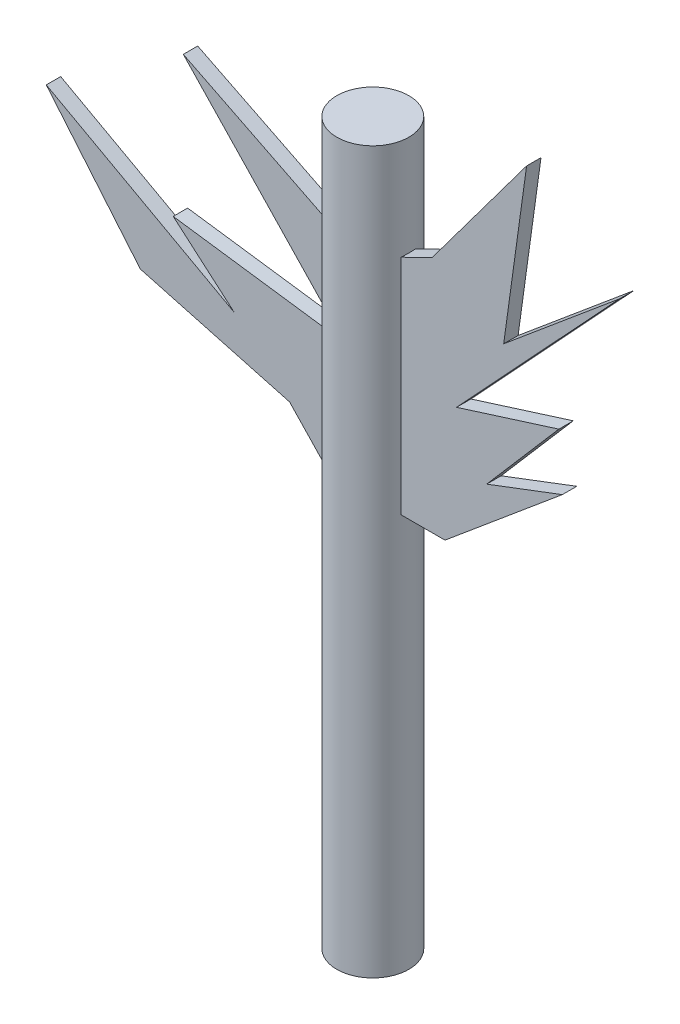
ISO-10303-21;
HEADER;
FILE_DESCRIPTION(('STEP AP214'),'2;1');
FILE_NAME('part.step','',(''),(''),'','','');
FILE_SCHEMA(('AUTOMOTIVE_DESIGN { 1 0 10303 214 1 1 1 1 }'));
ENDSEC;
DATA;
#1=APPLICATION_CONTEXT('core data for automotive mechanical design processes');
#2=APPLICATION_PROTOCOL_DEFINITION('international standard','automotive_design',2000,#1);
#3=PRODUCT_CONTEXT('',#1,'mechanical');
#4=PRODUCT('Part','Part','',(#3));
#5=PRODUCT_RELATED_PRODUCT_CATEGORY('part','',(#4));
#6=PRODUCT_DEFINITION_FORMATION('','',#4);
#7=PRODUCT_DEFINITION_CONTEXT('part definition',#1,'design');
#8=PRODUCT_DEFINITION('design','',#6,#7);
#9=PRODUCT_DEFINITION_SHAPE('','',#8);
#10=(LENGTH_UNIT() NAMED_UNIT(*) SI_UNIT(.MILLI.,.METRE.));
#11=(NAMED_UNIT(*) PLANE_ANGLE_UNIT() SI_UNIT($,.RADIAN.));
#12=(NAMED_UNIT(*) SI_UNIT($,.STERADIAN.) SOLID_ANGLE_UNIT());
#13=UNCERTAINTY_MEASURE_WITH_UNIT(LENGTH_MEASURE(1.E-05),#10,'distance_accuracy_value','');
#14=(GEOMETRIC_REPRESENTATION_CONTEXT(3) GLOBAL_UNCERTAINTY_ASSIGNED_CONTEXT((#13)) GLOBAL_UNIT_ASSIGNED_CONTEXT((#10,
#11,#12)) REPRESENTATION_CONTEXT('',''));
#15=CARTESIAN_POINT('',(0.,0.,0.));
#16=DIRECTION('',(0.,0.,1.));
#17=DIRECTION('',(1.,0.,0.));
#18=AXIS2_PLACEMENT_3D('',#15,#16,#17);
#19=CARTESIAN_POINT('',(0.,500.,0.));
#20=DIRECTION('',(0.,-1.,0.));
#21=DIRECTION('',(0.,0.,-1.));
#22=AXIS2_PLACEMENT_3D('',#19,#20,#21);
#23=CYLINDRICAL_SURFACE('',#22,25.);
#24=DIRECTION('',(0.,-1.,0.));
#25=VECTOR('',#24,1.);
#26=CARTESIAN_POINT('',(24.4948974278318,500.,-5.));
#27=LINE('',#26,#25);
#28=CARTESIAN_POINT('',(24.4948974278318,275.438238438683,-5.));
#29=VERTEX_POINT('',#28);
#30=CARTESIAN_POINT('',(24.4948974278318,430.165062365863,-5.));
#31=VERTEX_POINT('',#30);
#32=EDGE_CURVE('E414',#29,#31,#27,.F.);
#33=ORIENTED_EDGE('',*,*,#32,.F.);
#34=CARTESIAN_POINT('',(0.,275.438238438683,0.));
#35=DIRECTION('',(0.,-1.,0.));
#36=DIRECTION('',(0.,0.,-1.));
#37=AXIS2_PLACEMENT_3D('',#34,#35,#36);
#38=CIRCLE('',#37,25.);
#39=CARTESIAN_POINT('',(24.4948974278318,275.438238438683,5.));
#40=VERTEX_POINT('',#39);
#41=EDGE_CURVE('E404',#29,#40,#38,.T.);
#42=ORIENTED_EDGE('',*,*,#41,.T.);
#43=DIRECTION('',(0.,-1.,0.));
#44=VECTOR('',#43,1.);
#45=CARTESIAN_POINT('',(24.4948974278318,500.,5.));
#46=LINE('',#45,#44);
#47=CARTESIAN_POINT('',(24.4948974278318,430.165062365863,5.));
#48=VERTEX_POINT('',#47);
#49=EDGE_CURVE('E397',#40,#48,#46,.F.);
#50=ORIENTED_EDGE('',*,*,#49,.T.);
#51=CARTESIAN_POINT('',(0.,418.254378528517,0.));
#52=DIRECTION('',(-0.437294922049526,0.899318159023657,0.));
#53=DIRECTION('',(-0.899318159023657,-0.437294922049526,0.));
#54=AXIS2_PLACEMENT_3D('',#51,#52,#53);
#55=ELLIPSE('',#54,27.7988382077609,25.);
#56=EDGE_CURVE('E408',#48,#31,#55,.T.);
#57=ORIENTED_EDGE('',*,*,#56,.T.);
#58=EDGE_LOOP('',(#33,#42,#50,#57));
#59=FACE_BOUND('',#58,.T.);
#60=CARTESIAN_POINT('',(0.,500.,0.));
#61=DIRECTION('',(0.,1.,0.));
#62=DIRECTION('',(0.,0.,1.));
#63=AXIS2_PLACEMENT_3D('',#60,#61,#62);
#64=CIRCLE('',#63,25.);
#65=CARTESIAN_POINT('',(0.,500.,25.));
#66=VERTEX_POINT('',#65);
#67=EDGE_CURVE('E393',#66,#66,#64,.T.);
#68=ORIENTED_EDGE('',*,*,#67,.F.);
#69=EDGE_LOOP('',(#68));
#70=FACE_BOUND('',#69,.T.);
#71=CARTESIAN_POINT('',(0.,0.,0.));
#72=DIRECTION('',(0.,1.,0.));
#73=DIRECTION('',(0.,0.,1.));
#74=AXIS2_PLACEMENT_3D('',#71,#72,#73);
#75=CIRCLE('',#74,25.);
#76=CARTESIAN_POINT('',(0.,0.,25.));
#77=VERTEX_POINT('',#76);
#78=EDGE_CURVE('E347',#77,#77,#75,.T.);
#79=ORIENTED_EDGE('',*,*,#78,.T.);
#80=EDGE_LOOP('',(#79));
#81=FACE_BOUND('',#80,.T.);
#82=CARTESIAN_POINT('',(-24.4948974278318,275.438238438683,5.));
#83=VERTEX_POINT('',#82);
#84=CARTESIAN_POINT('',(-25.,275.438238438683,0.));
#85=VERTEX_POINT('',#84);
#86=EDGE_CURVE('E410',#83,#85,#38,.T.);
#87=ORIENTED_EDGE('',*,*,#86,.T.);
#88=CARTESIAN_POINT('',(-24.4948974278318,275.438238438683,-5.));
#89=VERTEX_POINT('',#88);
#90=EDGE_CURVE('E409',#85,#89,#38,.T.);
#91=ORIENTED_EDGE('',*,*,#90,.T.);
#92=DIRECTION('',(0.,-1.,0.));
#93=VECTOR('',#92,1.);
#94=CARTESIAN_POINT('',(-24.4948974278318,500.,-5.));
#95=LINE('',#94,#93);
#96=CARTESIAN_POINT('',(-24.4948974278318,360.607588319083,-5.));
#97=VERTEX_POINT('',#96);
#98=EDGE_CURVE('E49',#97,#89,#95,.T.);
#99=ORIENTED_EDGE('',*,*,#98,.F.);
#100=CARTESIAN_POINT('',(0.,357.216085375604,0.));
#101=DIRECTION('',(0.13714916051898,0.990550406475581,0.));
#102=DIRECTION('',(0.990550406475581,-0.13714916051898,0.));
#103=AXIS2_PLACEMENT_3D('',#100,#101,#102);
#104=ELLIPSE('',#103,25.2384935047889,25.);
#105=CARTESIAN_POINT('',(-24.4948974278318,360.607588319083,5.));
#106=VERTEX_POINT('',#105);
#107=EDGE_CURVE('E421',#97,#106,#104,.T.);
#108=ORIENTED_EDGE('',*,*,#107,.T.);
#109=DIRECTION('',(0.,-1.,0.));
#110=VECTOR('',#109,1.);
#111=CARTESIAN_POINT('',(-24.4948974278318,500.,5.));
#112=LINE('',#111,#110);
#113=EDGE_CURVE('E417',#106,#83,#112,.T.);
#114=ORIENTED_EDGE('',*,*,#113,.T.);
#115=EDGE_LOOP('',(#87,#91,#99,#108,#114));
#116=FACE_BOUND('',#115,.T.);
#117=CARTESIAN_POINT('',(-24.4948974278318,425.650247278352,-5.));
#118=VERTEX_POINT('',#117);
#119=CARTESIAN_POINT('',(-24.4948974278318,369.410425604163,-5.));
#120=VERTEX_POINT('',#119);
#121=EDGE_CURVE('E11',#118,#120,#95,.T.);
#122=ORIENTED_EDGE('',*,*,#121,.F.);
#123=CARTESIAN_POINT('',(0.,413.421374076424,0.));
#124=DIRECTION('',(0.446670723166173,0.89469842129413,0.));
#125=DIRECTION('',(0.89469842129413,-0.446670723166173,0.));
#126=AXIS2_PLACEMENT_3D('',#123,#124,#125);
#127=ELLIPSE('',#126,27.9423763415598,25.);
#128=CARTESIAN_POINT('',(-24.4948974278318,425.650247278352,5.));
#129=VERTEX_POINT('',#128);
#130=EDGE_CURVE('E425',#118,#129,#127,.T.);
#131=ORIENTED_EDGE('',*,*,#130,.T.);
#132=CARTESIAN_POINT('',(-24.4948974278318,369.410425604163,5.));
#133=VERTEX_POINT('',#132);
#134=EDGE_CURVE('E195',#129,#133,#112,.T.);
#135=ORIENTED_EDGE('',*,*,#134,.T.);
#136=CARTESIAN_POINT('',(0.,343.673383714767,0.));
#137=DIRECTION('',(-0.724370808954964,-0.689410567901255,0.));
#138=DIRECTION('',(0.689410567901255,-0.724370808954964,0.));
#139=AXIS2_PLACEMENT_3D('',#136,#137,#138);
#140=ELLIPSE('',#139,36.2628615863933,25.);
#141=EDGE_CURVE('E42',#133,#120,#140,.T.);
#142=ORIENTED_EDGE('',*,*,#141,.T.);
#143=EDGE_LOOP('',(#122,#131,#135,#142));
#144=FACE_BOUND('',#143,.T.);
#145=ADVANCED_FACE('F39',(#59,#70,#81,#116,#144),#23,.T.);
#146=CARTESIAN_POINT('',(0.,500.,0.));
#147=DIRECTION('',(0.,1.,0.));
#148=DIRECTION('',(0.,0.,1.));
#149=AXIS2_PLACEMENT_3D('',#146,#147,#148);
#150=PLANE('',#149);
#151=ORIENTED_EDGE('',*,*,#67,.T.);
#152=EDGE_LOOP('',(#151));
#153=FACE_BOUND('',#152,.T.);
#154=ADVANCED_FACE('F480',(#153),#150,.T.);
#155=CARTESIAN_POINT('',(0.,0.,0.));
#156=DIRECTION('',(0.,1.,0.));
#157=DIRECTION('',(0.,0.,1.));
#158=AXIS2_PLACEMENT_3D('',#155,#156,#157);
#159=PLANE('',#158);
#160=ORIENTED_EDGE('',*,*,#78,.F.);
#161=EDGE_LOOP('',(#160));
#162=FACE_BOUND('',#161,.T.);
#163=ADVANCED_FACE('F485',(#162),#159,.F.);
#164=CARTESIAN_POINT('',(111.692244321732,528.591191642201,-5.));
#165=DIRECTION('',(-0.801444478864867,0.598069182701317,0.));
#166=DIRECTION('',(-0.598069182701317,-0.801444478864867,0.));
#167=AXIS2_PLACEMENT_3D('',#164,#165,#166);
#168=PLANE('',#167);
#169=DIRECTION('',(0.,0.,1.));
#170=VECTOR('',#169,1.);
#171=CARTESIAN_POINT('',(46.0724517401596,440.657183353693,-5.));
#172=LINE('',#171,#170);
#173=CARTESIAN_POINT('',(46.0724517401596,440.657183353693,-5.));
#174=VERTEX_POINT('',#173);
#175=CARTESIAN_POINT('',(46.0724517401596,440.657183353693,5.));
#176=VERTEX_POINT('',#175);
#177=EDGE_CURVE('E344',#174,#176,#172,.T.);
#178=ORIENTED_EDGE('',*,*,#177,.T.);
#179=DIRECTION('',(-0.598069182701317,-0.801444478864867,0.));
#180=VECTOR('',#179,1.);
#181=CARTESIAN_POINT('',(111.692244321732,528.591191642201,5.));
#182=LINE('',#181,#180);
#183=CARTESIAN_POINT('',(111.692244321732,528.591191642201,5.));
#184=VERTEX_POINT('',#183);
#185=EDGE_CURVE('E272',#184,#176,#182,.T.);
#186=ORIENTED_EDGE('',*,*,#185,.F.);
#187=DIRECTION('',(0.,0.,1.));
#188=VECTOR('',#187,1.);
#189=CARTESIAN_POINT('',(111.692244321732,528.591191642201,-5.));
#190=LINE('',#189,#188);
#191=CARTESIAN_POINT('',(111.692244321732,528.591191642201,-5.));
#192=VERTEX_POINT('',#191);
#193=EDGE_CURVE('E348',#192,#184,#190,.T.);
#194=ORIENTED_EDGE('',*,*,#193,.F.);
#195=DIRECTION('',(-0.598069182701317,-0.801444478864867,0.));
#196=VECTOR('',#195,1.);
#197=CARTESIAN_POINT('',(111.692244321732,528.591191642201,-5.));
#198=LINE('',#197,#196);
#199=EDGE_CURVE('E211',#192,#174,#198,.T.);
#200=ORIENTED_EDGE('',*,*,#199,.T.);
#201=EDGE_LOOP('',(#178,#186,#194,#200));
#202=FACE_BOUND('',#201,.T.);
#203=ADVANCED_FACE('F495',(#202),#168,.T.);
#204=CARTESIAN_POINT('',(95.7950470712416,413.774774693616,-5.));
#205=DIRECTION('',(0.990550406475581,-0.13714916051898,0.));
#206=DIRECTION('',(0.13714916051898,0.990550406475581,0.));
#207=AXIS2_PLACEMENT_3D('',#204,#205,#206);
#208=PLANE('',#207);
#209=ORIENTED_EDGE('',*,*,#193,.T.);
#210=DIRECTION('',(0.13714916051898,0.990550406475581,0.));
#211=VECTOR('',#210,1.);
#212=CARTESIAN_POINT('',(95.7950470712416,413.774774693616,5.));
#213=LINE('',#212,#211);
#214=CARTESIAN_POINT('',(95.7950470712416,413.774774693616,5.));
#215=VERTEX_POINT('',#214);
#216=EDGE_CURVE('E268',#215,#184,#213,.T.);
#217=ORIENTED_EDGE('',*,*,#216,.F.);
#218=DIRECTION('',(0.,0.,1.));
#219=VECTOR('',#218,1.);
#220=CARTESIAN_POINT('',(95.7950470712416,413.774774693616,-5.));
#221=LINE('',#220,#219);
#222=CARTESIAN_POINT('',(95.7950470712416,413.774774693616,-5.));
#223=VERTEX_POINT('',#222);
#224=EDGE_CURVE('E351',#223,#215,#221,.T.);
#225=ORIENTED_EDGE('',*,*,#224,.F.);
#226=DIRECTION('',(0.13714916051898,0.990550406475581,0.));
#227=VECTOR('',#226,1.);
#228=CARTESIAN_POINT('',(95.7950470712416,413.774774693616,-5.));
#229=LINE('',#228,#227);
#230=EDGE_CURVE('E337',#223,#192,#229,.T.);
#231=ORIENTED_EDGE('',*,*,#230,.T.);
#232=EDGE_LOOP('',(#209,#217,#225,#231));
#233=FACE_BOUND('',#232,.T.);
#234=ADVANCED_FACE('F499',(#233),#208,.T.);
#235=CARTESIAN_POINT('',(176.005774191457,480.837199539356,-5.));
#236=DIRECTION('',(-0.64142625339715,0.767184698395957,0.));
#237=DIRECTION('',(-0.767184698395957,-0.64142625339715,0.));
#238=AXIS2_PLACEMENT_3D('',#235,#236,#237);
#239=PLANE('',#238);
#240=ORIENTED_EDGE('',*,*,#224,.T.);
#241=DIRECTION('',(-0.767184698395957,-0.64142625339715,0.));
#242=VECTOR('',#241,1.);
#243=CARTESIAN_POINT('',(176.005774191457,480.837199539356,5.));
#244=LINE('',#243,#242);
#245=CARTESIAN_POINT('',(176.005774191457,480.837199539356,5.));
#246=VERTEX_POINT('',#245);
#247=EDGE_CURVE('E264',#246,#215,#244,.T.);
#248=ORIENTED_EDGE('',*,*,#247,.F.);
#249=DIRECTION('',(0.,0.,1.));
#250=VECTOR('',#249,1.);
#251=CARTESIAN_POINT('',(176.005774191457,480.837199539356,-5.));
#252=LINE('',#251,#250);
#253=CARTESIAN_POINT('',(176.005774191457,480.837199539356,-5.));
#254=VERTEX_POINT('',#253);
#255=EDGE_CURVE('E354',#254,#246,#252,.T.);
#256=ORIENTED_EDGE('',*,*,#255,.F.);
#257=DIRECTION('',(-0.767184698395957,-0.64142625339715,0.));
#258=VECTOR('',#257,1.);
#259=CARTESIAN_POINT('',(176.005774191457,480.837199539356,-5.));
#260=LINE('',#259,#258);
#261=EDGE_CURVE('E333',#254,#223,#260,.T.);
#262=ORIENTED_EDGE('',*,*,#261,.T.);
#263=EDGE_LOOP('',(#240,#248,#256,#262));
#264=FACE_BOUND('',#263,.T.);
#265=ADVANCED_FACE('F642',(#264),#239,.T.);
#266=CARTESIAN_POINT('',(63.0845103352759,359.271534235287,-5.));
#267=DIRECTION('',(0.732676695908877,-0.680576857725894,0.));
#268=DIRECTION('',(0.680576857725894,0.732676695908877,0.));
#269=AXIS2_PLACEMENT_3D('',#266,#267,#268);
#270=PLANE('',#269);
#271=ORIENTED_EDGE('',*,*,#255,.T.);
#272=DIRECTION('',(0.680576857725894,0.732676695908877,0.));
#273=VECTOR('',#272,1.);
#274=CARTESIAN_POINT('',(63.0845103352759,359.271534235287,5.));
#275=LINE('',#274,#273);
#276=CARTESIAN_POINT('',(63.0845103352759,359.271534235287,5.));
#277=VERTEX_POINT('',#276);
#278=EDGE_CURVE('E260',#277,#246,#275,.T.);
#279=ORIENTED_EDGE('',*,*,#278,.F.);
#280=DIRECTION('',(0.,0.,1.));
#281=VECTOR('',#280,1.);
#282=CARTESIAN_POINT('',(63.0845103352759,359.271534235287,-5.));
#283=LINE('',#282,#281);
#284=CARTESIAN_POINT('',(63.0845103352759,359.271534235287,-5.));
#285=VERTEX_POINT('',#284);
#286=EDGE_CURVE('E357',#285,#277,#283,.T.);
#287=ORIENTED_EDGE('',*,*,#286,.F.);
#288=DIRECTION('',(0.680576857725894,0.732676695908877,0.));
#289=VECTOR('',#288,1.);
#290=CARTESIAN_POINT('',(63.0845103352759,359.271534235287,-5.));
#291=LINE('',#290,#289);
#292=EDGE_CURVE('E329',#285,#254,#291,.T.);
#293=ORIENTED_EDGE('',*,*,#292,.T.);
#294=EDGE_LOOP('',(#271,#279,#287,#293));
#295=FACE_BOUND('',#294,.T.);
#296=ADVANCED_FACE('F637',(#295),#270,.T.);
#297=CARTESIAN_POINT('',(134.080402496634,381.655252368529,-5.));
#298=DIRECTION('',(-0.30069112863177,0.953721576332502,0.));
#299=DIRECTION('',(-0.953721576332502,-0.30069112863177,0.));
#300=AXIS2_PLACEMENT_3D('',#297,#298,#299);
#301=PLANE('',#300);
#302=ORIENTED_EDGE('',*,*,#286,.T.);
#303=DIRECTION('',(-0.953721576332502,-0.30069112863177,0.));
#304=VECTOR('',#303,1.);
#305=CARTESIAN_POINT('',(134.080402496634,381.655252368529,5.));
#306=LINE('',#305,#304);
#307=CARTESIAN_POINT('',(134.080402496634,381.655252368529,5.));
#308=VERTEX_POINT('',#307);
#309=EDGE_CURVE('E256',#308,#277,#306,.T.);
#310=ORIENTED_EDGE('',*,*,#309,.F.);
#311=DIRECTION('',(0.,0.,1.));
#312=VECTOR('',#311,1.);
#313=CARTESIAN_POINT('',(134.080402496634,381.655252368529,-5.));
#314=LINE('',#313,#312);
#315=CARTESIAN_POINT('',(134.080402496634,381.655252368529,-5.));
#316=VERTEX_POINT('',#315);
#317=EDGE_CURVE('E360',#316,#308,#314,.T.);
#318=ORIENTED_EDGE('',*,*,#317,.F.);
#319=DIRECTION('',(-0.953721576332502,-0.30069112863177,0.));
#320=VECTOR('',#319,1.);
#321=CARTESIAN_POINT('',(134.080402496634,381.655252368529,-5.));
#322=LINE('',#321,#320);
#323=EDGE_CURVE('E325',#316,#285,#322,.T.);
#324=ORIENTED_EDGE('',*,*,#323,.T.);
#325=EDGE_LOOP('',(#302,#310,#318,#324));
#326=FACE_BOUND('',#325,.T.);
#327=ADVANCED_FACE('F632',(#326),#301,.T.);
#328=CARTESIAN_POINT('',(84.0090542982762,323.576399454984,-5.));
#329=DIRECTION('',(0.757388217453221,-0.652964844431178,0.));
#330=DIRECTION('',(0.652964844431178,0.757388217453221,0.));
#331=AXIS2_PLACEMENT_3D('',#328,#329,#330);
#332=PLANE('',#331);
#333=ORIENTED_EDGE('',*,*,#317,.T.);
#334=DIRECTION('',(0.652964844431178,0.757388217453221,0.));
#335=VECTOR('',#334,1.);
#336=CARTESIAN_POINT('',(84.0090542982762,323.576399454984,5.));
#337=LINE('',#336,#335);
#338=CARTESIAN_POINT('',(84.0090542982762,323.576399454984,5.));
#339=VERTEX_POINT('',#338);
#340=EDGE_CURVE('E252',#339,#308,#337,.T.);
#341=ORIENTED_EDGE('',*,*,#340,.F.);
#342=DIRECTION('',(0.,0.,1.));
#343=VECTOR('',#342,1.);
#344=CARTESIAN_POINT('',(84.0090542982762,323.576399454984,-5.));
#345=LINE('',#344,#343);
#346=CARTESIAN_POINT('',(84.0090542982762,323.576399454984,-5.));
#347=VERTEX_POINT('',#346);
#348=EDGE_CURVE('E363',#347,#339,#345,.T.);
#349=ORIENTED_EDGE('',*,*,#348,.F.);
#350=DIRECTION('',(0.652964844431178,0.757388217453221,0.));
#351=VECTOR('',#350,1.);
#352=CARTESIAN_POINT('',(84.0090542982762,323.576399454984,-5.));
#353=LINE('',#352,#351);
#354=EDGE_CURVE('E321',#347,#316,#353,.T.);
#355=ORIENTED_EDGE('',*,*,#354,.T.);
#356=EDGE_LOOP('',(#333,#341,#349,#355));
#357=FACE_BOUND('',#356,.T.);
#358=ADVANCED_FACE('F630',(#357),#332,.T.);
#359=CARTESIAN_POINT('',(136.510624595424,343.521036233899,-5.));
#360=DIRECTION('',(-0.355125029197698,0.934818813266685,0.));
#361=DIRECTION('',(-0.934818813266686,-0.355125029197698,0.));
#362=AXIS2_PLACEMENT_3D('',#359,#360,#361);
#363=PLANE('',#362);
#364=ORIENTED_EDGE('',*,*,#348,.T.);
#365=DIRECTION('',(-0.934818813266686,-0.355125029197698,0.));
#366=VECTOR('',#365,1.);
#367=CARTESIAN_POINT('',(136.510624595424,343.521036233899,5.));
#368=LINE('',#367,#366);
#369=CARTESIAN_POINT('',(136.510624595424,343.521036233899,5.));
#370=VERTEX_POINT('',#369);
#371=EDGE_CURVE('E248',#370,#339,#368,.T.);
#372=ORIENTED_EDGE('',*,*,#371,.F.);
#373=DIRECTION('',(0.,0.,1.));
#374=VECTOR('',#373,1.);
#375=CARTESIAN_POINT('',(136.510624595424,343.521036233899,-5.));
#376=LINE('',#375,#374);
#377=CARTESIAN_POINT('',(136.510624595424,343.521036233899,-5.));
#378=VERTEX_POINT('',#377);
#379=EDGE_CURVE('E366',#378,#370,#376,.T.);
#380=ORIENTED_EDGE('',*,*,#379,.F.);
#381=DIRECTION('',(-0.934818813266686,-0.355125029197698,0.));
#382=VECTOR('',#381,1.);
#383=CARTESIAN_POINT('',(136.510624595424,343.521036233899,-5.));
#384=LINE('',#383,#382);
#385=EDGE_CURVE('E317',#378,#347,#384,.T.);
#386=ORIENTED_EDGE('',*,*,#385,.T.);
#387=EDGE_LOOP('',(#364,#372,#380,#386));
#388=FACE_BOUND('',#387,.T.);
#389=ADVANCED_FACE('F609',(#388),#363,.T.);
#390=CARTESIAN_POINT('',(55.0794695470591,275.438238438683,-5.));
#391=DIRECTION('',(0.64142625339715,-0.767184698395957,0.));
#392=DIRECTION('',(0.767184698395957,0.64142625339715,0.));
#393=AXIS2_PLACEMENT_3D('',#390,#391,#392);
#394=PLANE('',#393);
#395=ORIENTED_EDGE('',*,*,#379,.T.);
#396=DIRECTION('',(0.767184698395957,0.64142625339715,0.));
#397=VECTOR('',#396,1.);
#398=CARTESIAN_POINT('',(55.0794695470591,275.438238438683,5.));
#399=LINE('',#398,#397);
#400=CARTESIAN_POINT('',(55.0794695470591,275.438238438683,5.));
#401=VERTEX_POINT('',#400);
#402=EDGE_CURVE('E244',#401,#370,#399,.T.);
#403=ORIENTED_EDGE('',*,*,#402,.F.);
#404=DIRECTION('',(0.,0.,1.));
#405=VECTOR('',#404,1.);
#406=CARTESIAN_POINT('',(55.0794695470591,275.438238438683,-5.));
#407=LINE('',#406,#405);
#408=CARTESIAN_POINT('',(55.0794695470591,275.438238438683,-5.));
#409=VERTEX_POINT('',#408);
#410=EDGE_CURVE('E369',#409,#401,#407,.T.);
#411=ORIENTED_EDGE('',*,*,#410,.F.);
#412=DIRECTION('',(0.767184698395957,0.64142625339715,0.));
#413=VECTOR('',#412,1.);
#414=CARTESIAN_POINT('',(55.0794695470591,275.438238438683,-5.));
#415=LINE('',#414,#413);
#416=EDGE_CURVE('E313',#409,#378,#415,.T.);
#417=ORIENTED_EDGE('',*,*,#416,.T.);
#418=EDGE_LOOP('',(#395,#403,#411,#417));
#419=FACE_BOUND('',#418,.T.);
#420=ADVANCED_FACE('F602',(#419),#394,.T.);
#421=CARTESIAN_POINT('',(0.,0.,5.));
#422=DIRECTION('',(0.,0.,1.));
#423=DIRECTION('',(1.,0.,0.));
#424=AXIS2_PLACEMENT_3D('',#421,#422,#423);
#425=PLANE('',#424);
#426=ORIENTED_EDGE('',*,*,#49,.F.);
#427=DIRECTION('',(1.,0.,0.));
#428=VECTOR('',#427,1.);
#429=CARTESIAN_POINT('',(-25.,275.438238438683,5.));
#430=LINE('',#429,#428);
#431=EDGE_CURVE('E241',#40,#401,#430,.T.);
#432=ORIENTED_EDGE('',*,*,#431,.T.);
#433=ORIENTED_EDGE('',*,*,#402,.T.);
#434=ORIENTED_EDGE('',*,*,#371,.T.);
#435=ORIENTED_EDGE('',*,*,#340,.T.);
#436=ORIENTED_EDGE('',*,*,#309,.T.);
#437=ORIENTED_EDGE('',*,*,#278,.T.);
#438=ORIENTED_EDGE('',*,*,#247,.T.);
#439=ORIENTED_EDGE('',*,*,#216,.T.);
#440=ORIENTED_EDGE('',*,*,#185,.T.);
#441=DIRECTION('',(-0.899318159023657,-0.437294922049526,0.));
#442=VECTOR('',#441,1.);
#443=CARTESIAN_POINT('',(46.0724517401596,440.657183353693,5.));
#444=LINE('',#443,#442);
#445=EDGE_CURVE('E199',#176,#48,#444,.T.);
#446=ORIENTED_EDGE('',*,*,#445,.T.);
#447=EDGE_LOOP('',(#426,#432,#433,#434,#435,#436,#437,#438,#439,#440,#446));
#448=FACE_BOUND('',#447,.T.);
#449=ADVANCED_FACE('F554',(#448),#425,.T.);
#450=CARTESIAN_POINT('',(0.,0.,-5.));
#451=DIRECTION('',(0.,0.,1.));
#452=DIRECTION('',(1.,0.,0.));
#453=AXIS2_PLACEMENT_3D('',#450,#451,#452);
#454=PLANE('',#453);
#455=DIRECTION('',(1.,0.,0.));
#456=VECTOR('',#455,1.);
#457=CARTESIAN_POINT('',(-25.,275.438238438683,-5.));
#458=LINE('',#457,#456);
#459=EDGE_CURVE('E308',#29,#409,#458,.T.);
#460=ORIENTED_EDGE('',*,*,#459,.F.);
#461=ORIENTED_EDGE('',*,*,#32,.T.);
#462=DIRECTION('',(-0.899318159023657,-0.437294922049526,0.));
#463=VECTOR('',#462,1.);
#464=CARTESIAN_POINT('',(46.0724517401596,440.657183353693,-5.));
#465=LINE('',#464,#463);
#466=EDGE_CURVE('E276',#174,#31,#465,.T.);
#467=ORIENTED_EDGE('',*,*,#466,.F.);
#468=ORIENTED_EDGE('',*,*,#199,.F.);
#469=ORIENTED_EDGE('',*,*,#230,.F.);
#470=ORIENTED_EDGE('',*,*,#261,.F.);
#471=ORIENTED_EDGE('',*,*,#292,.F.);
#472=ORIENTED_EDGE('',*,*,#323,.F.);
#473=ORIENTED_EDGE('',*,*,#354,.F.);
#474=ORIENTED_EDGE('',*,*,#385,.F.);
#475=ORIENTED_EDGE('',*,*,#416,.F.);
#476=EDGE_LOOP('',(#460,#461,#467,#468,#469,#470,#471,#472,#473,#474,#475));
#477=FACE_BOUND('',#476,.T.);
#478=ADVANCED_FACE('F563',(#477),#454,.F.);
#479=CARTESIAN_POINT('',(-25.,275.438238438683,-5.));
#480=DIRECTION('',(0.,-1.,0.));
#481=DIRECTION('',(0.,0.,-1.));
#482=AXIS2_PLACEMENT_3D('',#479,#480,#481);
#483=PLANE('',#482);
#484=ORIENTED_EDGE('',*,*,#41,.F.);
#485=ORIENTED_EDGE('',*,*,#459,.T.);
#486=ORIENTED_EDGE('',*,*,#410,.T.);
#487=ORIENTED_EDGE('',*,*,#431,.F.);
#488=EDGE_LOOP('',(#484,#485,#486,#487));
#489=FACE_BOUND('',#488,.T.);
#490=ADVANCED_FACE('F506',(#489),#483,.T.);
#491=CARTESIAN_POINT('',(46.0724517401596,440.657183353693,-5.));
#492=DIRECTION('',(-0.437294922049526,0.899318159023657,0.));
#493=DIRECTION('',(-0.899318159023657,-0.437294922049526,0.));
#494=AXIS2_PLACEMENT_3D('',#491,#492,#493);
#495=PLANE('',#494);
#496=ORIENTED_EDGE('',*,*,#56,.F.);
#497=ORIENTED_EDGE('',*,*,#445,.F.);
#498=ORIENTED_EDGE('',*,*,#177,.F.);
#499=ORIENTED_EDGE('',*,*,#466,.T.);
#500=EDGE_LOOP('',(#496,#497,#498,#499));
#501=FACE_BOUND('',#500,.T.);
#502=ADVANCED_FACE('F503',(#501),#495,.T.);
#503=CARTESIAN_POINT('',(-14.8453384311207,359.271534235287,-5.));
#504=DIRECTION('',(0.13714916051898,0.990550406475581,0.));
#505=DIRECTION('',(-0.990550406475581,0.13714916051898,0.));
#506=AXIS2_PLACEMENT_3D('',#503,#504,#505);
#507=PLANE('',#506);
#508=ORIENTED_EDGE('',*,*,#107,.F.);
#509=DIRECTION('',(-0.990550406475581,0.13714916051898,0.));
#510=VECTOR('',#509,1.);
#511=CARTESIAN_POINT('',(-14.8453384311207,359.271534235287,-5.));
#512=LINE('',#511,#510);
#513=CARTESIAN_POINT('',(-133.47487545297,375.696686664623,-5.));
#514=VERTEX_POINT('',#513);
#515=EDGE_CURVE('E285',#97,#514,#512,.T.);
#516=ORIENTED_EDGE('',*,*,#515,.T.);
#517=DIRECTION('',(0.,0.,1.));
#518=VECTOR('',#517,1.);
#519=CARTESIAN_POINT('',(-133.47487545297,375.696686664623,-5.));
#520=LINE('',#519,#518);
#521=CARTESIAN_POINT('',(-133.47487545297,375.696686664623,5.));
#522=VERTEX_POINT('',#521);
#523=EDGE_CURVE('E210',#514,#522,#520,.T.);
#524=ORIENTED_EDGE('',*,*,#523,.T.);
#525=DIRECTION('',(-0.990550406475581,0.13714916051898,0.));
#526=VECTOR('',#525,1.);
#527=CARTESIAN_POINT('',(-14.8453384311207,359.271534235287,5.));
#528=LINE('',#527,#526);
#529=EDGE_CURVE('E216',#106,#522,#528,.T.);
#530=ORIENTED_EDGE('',*,*,#529,.F.);
#531=EDGE_LOOP('',(#508,#516,#524,#530));
#532=FACE_BOUND('',#531,.T.);
#533=ADVANCED_FACE('F455',(#532),#507,.T.);
#534=CARTESIAN_POINT('',(-133.47487545297,375.696686664623,-5.));
#535=DIRECTION('',(-0.652964844431178,-0.757388217453221,0.));
#536=DIRECTION('',(0.757388217453221,-0.652964844431178,0.));
#537=AXIS2_PLACEMENT_3D('',#534,#535,#536);
#538=PLANE('',#537);
#539=DIRECTION('',(0.,0.,1.));
#540=VECTOR('',#539,1.);
#541=CARTESIAN_POINT('',(-91.0534042737776,339.123990270948,-5.));
#542=LINE('',#541,#540);
#543=CARTESIAN_POINT('',(-91.0534042737776,339.123990270948,-5.));
#544=VERTEX_POINT('',#543);
#545=CARTESIAN_POINT('',(-91.0534042737776,339.123990270948,5.));
#546=VERTEX_POINT('',#545);
#547=EDGE_CURVE('E387',#544,#546,#542,.T.);
#548=ORIENTED_EDGE('',*,*,#547,.T.);
#549=DIRECTION('',(0.757388217453221,-0.652964844431178,0.));
#550=VECTOR('',#549,1.);
#551=CARTESIAN_POINT('',(-133.47487545297,375.696686664623,5.));
#552=LINE('',#551,#550);
#553=EDGE_CURVE('E219',#522,#546,#552,.T.);
#554=ORIENTED_EDGE('',*,*,#553,.F.);
#555=ORIENTED_EDGE('',*,*,#523,.F.);
#556=DIRECTION('',(0.757388217453221,-0.652964844431178,0.));
#557=VECTOR('',#556,1.);
#558=CARTESIAN_POINT('',(-133.47487545297,375.696686664623,-5.));
#559=LINE('',#558,#557);
#560=EDGE_CURVE('E288',#514,#544,#559,.T.);
#561=ORIENTED_EDGE('',*,*,#560,.T.);
#562=EDGE_LOOP('',(#548,#554,#555,#561));
#563=FACE_BOUND('',#562,.T.);
#564=ADVANCED_FACE('F514',(#563),#538,.T.);
#565=CARTESIAN_POINT('',(-91.0534042737776,339.123990270948,-5.));
#566=DIRECTION('',(0.480801269286145,0.876829595447617,0.));
#567=DIRECTION('',(-0.876829595447617,0.480801269286145,0.));
#568=AXIS2_PLACEMENT_3D('',#565,#566,#567);
#569=PLANE('',#568);
#570=DIRECTION('',(0.,0.,1.));
#571=VECTOR('',#570,1.);
#572=CARTESIAN_POINT('',(-221.536557101223,410.673201001988,-5.));
#573=LINE('',#572,#571);
#574=CARTESIAN_POINT('',(-221.536557101223,410.673201001988,-5.));
#575=VERTEX_POINT('',#574);
#576=CARTESIAN_POINT('',(-221.536557101223,410.673201001988,5.));
#577=VERTEX_POINT('',#576);
#578=EDGE_CURVE('E384',#575,#577,#573,.T.);
#579=ORIENTED_EDGE('',*,*,#578,.T.);
#580=DIRECTION('',(-0.876829595447617,0.480801269286145,0.));
#581=VECTOR('',#580,1.);
#582=CARTESIAN_POINT('',(-91.0534042737776,339.123990270948,5.));
#583=LINE('',#582,#581);
#584=EDGE_CURVE('E226',#546,#577,#583,.T.);
#585=ORIENTED_EDGE('',*,*,#584,.F.);
#586=ORIENTED_EDGE('',*,*,#547,.F.);
#587=DIRECTION('',(-0.876829595447617,0.480801269286145,0.));
#588=VECTOR('',#587,1.);
#589=CARTESIAN_POINT('',(-91.0534042737776,339.123990270948,-5.));
#590=LINE('',#589,#588);
#591=EDGE_CURVE('E292',#544,#575,#590,.T.);
#592=ORIENTED_EDGE('',*,*,#591,.T.);
#593=EDGE_LOOP('',(#579,#585,#586,#592));
#594=FACE_BOUND('',#593,.T.);
#595=ADVANCED_FACE('F463',(#594),#569,.T.);
#596=CARTESIAN_POINT('',(-221.536557101223,410.673201001988,-5.));
#597=DIRECTION('',(-0.767184698395957,-0.64142625339715,0.));
#598=DIRECTION('',(0.64142625339715,-0.767184698395957,0.));
#599=AXIS2_PLACEMENT_3D('',#596,#597,#598);
#600=PLANE('',#599);
#601=DIRECTION('',(0.,0.,1.));
#602=VECTOR('',#601,1.);
#603=CARTESIAN_POINT('',(-156.2949806875,332.640319031926,-5.));
#604=LINE('',#603,#602);
#605=CARTESIAN_POINT('',(-156.2949806875,332.640319031926,-5.));
#606=VERTEX_POINT('',#605);
#607=CARTESIAN_POINT('',(-156.2949806875,332.640319031926,5.));
#608=VERTEX_POINT('',#607);
#609=EDGE_CURVE('E381',#606,#608,#604,.T.);
#610=ORIENTED_EDGE('',*,*,#609,.T.);
#611=DIRECTION('',(0.64142625339715,-0.767184698395957,0.));
#612=VECTOR('',#611,1.);
#613=CARTESIAN_POINT('',(-221.536557101223,410.673201001988,5.));
#614=LINE('',#613,#612);
#615=EDGE_CURVE('E230',#577,#608,#614,.T.);
#616=ORIENTED_EDGE('',*,*,#615,.F.);
#617=ORIENTED_EDGE('',*,*,#578,.F.);
#618=DIRECTION('',(0.64142625339715,-0.767184698395957,0.));
#619=VECTOR('',#618,1.);
#620=CARTESIAN_POINT('',(-221.536557101223,410.673201001988,-5.));
#621=LINE('',#620,#619);
#622=EDGE_CURVE('E296',#575,#606,#621,.T.);
#623=ORIENTED_EDGE('',*,*,#622,.T.);
#624=EDGE_LOOP('',(#610,#616,#617,#623));
#625=FACE_BOUND('',#624,.T.);
#626=ADVANCED_FACE('F467',(#625),#600,.T.);
#627=CARTESIAN_POINT('',(-156.2949806875,332.640319031926,-5.));
#628=DIRECTION('',(-0.261564901647444,-0.965185889985014,0.));
#629=DIRECTION('',(0.965185889985014,-0.261564901647444,0.));
#630=AXIS2_PLACEMENT_3D('',#627,#628,#629);
#631=PLANE('',#630);
#632=DIRECTION('',(0.,0.,1.));
#633=VECTOR('',#632,1.);
#634=CARTESIAN_POINT('',(-52.7297744644146,304.574199063824,-5.));
#635=LINE('',#634,#633);
#636=CARTESIAN_POINT('',(-52.7297744644146,304.574199063824,-5.));
#637=VERTEX_POINT('',#636);
#638=CARTESIAN_POINT('',(-52.7297744644146,304.574199063824,5.));
#639=VERTEX_POINT('',#638);
#640=EDGE_CURVE('E378',#637,#639,#635,.T.);
#641=ORIENTED_EDGE('',*,*,#640,.T.);
#642=DIRECTION('',(0.965185889985014,-0.261564901647444,0.));
#643=VECTOR('',#642,1.);
#644=CARTESIAN_POINT('',(-156.2949806875,332.640319031926,5.));
#645=LINE('',#644,#643);
#646=EDGE_CURVE('E234',#608,#639,#645,.T.);
#647=ORIENTED_EDGE('',*,*,#646,.F.);
#648=ORIENTED_EDGE('',*,*,#609,.F.);
#649=DIRECTION('',(0.965185889985014,-0.261564901647444,0.));
#650=VECTOR('',#649,1.);
#651=CARTESIAN_POINT('',(-156.2949806875,332.640319031926,-5.));
#652=LINE('',#651,#650);
#653=EDGE_CURVE('E300',#606,#637,#652,.T.);
#654=ORIENTED_EDGE('',*,*,#653,.T.);
#655=EDGE_LOOP('',(#641,#647,#648,#654));
#656=FACE_BOUND('',#655,.T.);
#657=ADVANCED_FACE('F469',(#656),#631,.T.);
#658=CARTESIAN_POINT('',(-52.7297744644146,304.574199063824,-5.));
#659=DIRECTION('',(-0.724370808954964,-0.689410567901255,0.));
#660=DIRECTION('',(0.689410567901255,-0.724370808954964,0.));
#661=AXIS2_PLACEMENT_3D('',#658,#659,#660);
#662=PLANE('',#661);
#663=DIRECTION('',(0.,0.,1.));
#664=VECTOR('',#663,1.);
#665=CARTESIAN_POINT('',(-25.,275.438238438683,-5.));
#666=LINE('',#665,#664);
#667=CARTESIAN_POINT('',(-25.,275.438238438683,-5.));
#668=VERTEX_POINT('',#667);
#669=EDGE_CURVE('E373',#668,#85,#666,.T.);
#670=ORIENTED_EDGE('',*,*,#669,.T.);
#671=CARTESIAN_POINT('',(-25.,275.438238438683,5.));
#672=VERTEX_POINT('',#671);
#673=EDGE_CURVE('E377',#85,#672,#666,.T.);
#674=ORIENTED_EDGE('',*,*,#673,.T.);
#675=DIRECTION('',(0.689410567901255,-0.724370808954964,0.));
#676=VECTOR('',#675,1.);
#677=CARTESIAN_POINT('',(-52.7297744644146,304.574199063824,5.));
#678=LINE('',#677,#676);
#679=EDGE_CURVE('E238',#639,#672,#678,.T.);
#680=ORIENTED_EDGE('',*,*,#679,.F.);
#681=ORIENTED_EDGE('',*,*,#640,.F.);
#682=DIRECTION('',(0.689410567901255,-0.724370808954964,0.));
#683=VECTOR('',#682,1.);
#684=CARTESIAN_POINT('',(-52.7297744644146,304.574199063824,-5.));
#685=LINE('',#684,#683);
#686=EDGE_CURVE('E304',#637,#668,#685,.T.);
#687=ORIENTED_EDGE('',*,*,#686,.T.);
#688=EDGE_LOOP('',(#670,#674,#680,#681,#687));
#689=FACE_BOUND('',#688,.T.);
#690=ADVANCED_FACE('F443',(#689),#662,.T.);
#691=ORIENTED_EDGE('',*,*,#90,.F.);
#692=ORIENTED_EDGE('',*,*,#669,.F.);
#693=EDGE_CURVE('E309',#668,#89,#458,.T.);
#694=ORIENTED_EDGE('',*,*,#693,.T.);
#695=EDGE_LOOP('',(#691,#692,#694));
#696=FACE_BOUND('',#695,.T.);
#697=ADVANCED_FACE('F447',(#696),#483,.T.);
#698=ORIENTED_EDGE('',*,*,#113,.F.);
#699=ORIENTED_EDGE('',*,*,#529,.T.);
#700=ORIENTED_EDGE('',*,*,#553,.T.);
#701=ORIENTED_EDGE('',*,*,#584,.T.);
#702=ORIENTED_EDGE('',*,*,#615,.T.);
#703=ORIENTED_EDGE('',*,*,#646,.T.);
#704=ORIENTED_EDGE('',*,*,#679,.T.);
#705=EDGE_CURVE('E64',#672,#83,#430,.T.);
#706=ORIENTED_EDGE('',*,*,#705,.T.);
#707=EDGE_LOOP('',(#698,#699,#700,#701,#702,#703,#704,#706));
#708=FACE_BOUND('',#707,.T.);
#709=ADVANCED_FACE('F458',(#708),#425,.T.);
#710=ORIENTED_EDGE('',*,*,#515,.F.);
#711=ORIENTED_EDGE('',*,*,#98,.T.);
#712=ORIENTED_EDGE('',*,*,#693,.F.);
#713=ORIENTED_EDGE('',*,*,#686,.F.);
#714=ORIENTED_EDGE('',*,*,#653,.F.);
#715=ORIENTED_EDGE('',*,*,#622,.F.);
#716=ORIENTED_EDGE('',*,*,#591,.F.);
#717=ORIENTED_EDGE('',*,*,#560,.F.);
#718=EDGE_LOOP('',(#710,#711,#712,#713,#714,#715,#716,#717));
#719=FACE_BOUND('',#718,.T.);
#720=ADVANCED_FACE('F450',(#719),#454,.F.);
#721=ORIENTED_EDGE('',*,*,#86,.F.);
#722=ORIENTED_EDGE('',*,*,#705,.F.);
#723=ORIENTED_EDGE('',*,*,#673,.F.);
#724=EDGE_LOOP('',(#721,#722,#723));
#725=FACE_BOUND('',#724,.T.);
#726=ADVANCED_FACE('F439',(#725),#483,.T.);
#727=DIRECTION('',(-0.89469842129413,0.446670723166173,0.));
#728=VECTOR('',#727,1.);
#729=CARTESIAN_POINT('',(-4.90414750070478,415.869728805255,-5.));
#730=LINE('',#729,#728);
#731=CARTESIAN_POINT('',(-126.476794096529,476.563858446879,-5.));
#732=VERTEX_POINT('',#731);
#733=EDGE_CURVE('E205',#118,#732,#730,.T.);
#734=ORIENTED_EDGE('',*,*,#733,.F.);
#735=ORIENTED_EDGE('',*,*,#121,.T.);
#736=DIRECTION('',(0.689410567901255,-0.724370808954964,0.));
#737=VECTOR('',#736,1.);
#738=CARTESIAN_POINT('',(-126.476794096529,476.563858446879,-5.));
#739=LINE('',#738,#737);
#740=EDGE_CURVE('E282',#732,#120,#739,.T.);
#741=ORIENTED_EDGE('',*,*,#740,.F.);
#742=EDGE_LOOP('',(#734,#735,#741));
#743=FACE_BOUND('',#742,.T.);
#744=ADVANCED_FACE('F564',(#743),#454,.F.);
#745=ORIENTED_EDGE('',*,*,#134,.F.);
#746=DIRECTION('',(-0.89469842129413,0.446670723166173,0.));
#747=VECTOR('',#746,1.);
#748=CARTESIAN_POINT('',(-4.90414750070478,415.869728805255,5.));
#749=LINE('',#748,#747);
#750=CARTESIAN_POINT('',(-126.476794096529,476.563858446879,5.));
#751=VERTEX_POINT('',#750);
#752=EDGE_CURVE('E191',#129,#751,#749,.T.);
#753=ORIENTED_EDGE('',*,*,#752,.T.);
#754=DIRECTION('',(0.689410567901255,-0.724370808954964,0.));
#755=VECTOR('',#754,1.);
#756=CARTESIAN_POINT('',(-126.476794096529,476.563858446879,5.));
#757=LINE('',#756,#755);
#758=EDGE_CURVE('E56',#751,#133,#757,.T.);
#759=ORIENTED_EDGE('',*,*,#758,.T.);
#760=EDGE_LOOP('',(#745,#753,#759));
#761=FACE_BOUND('',#760,.T.);
#762=ADVANCED_FACE('F193',(#761),#425,.T.);
#763=CARTESIAN_POINT('',(-126.476794096529,476.563858446879,-5.));
#764=DIRECTION('',(-0.724370808954964,-0.689410567901255,0.));
#765=DIRECTION('',(0.689410567901255,-0.724370808954964,0.));
#766=AXIS2_PLACEMENT_3D('',#763,#764,#765);
#767=PLANE('',#766);
#768=ORIENTED_EDGE('',*,*,#141,.F.);
#769=ORIENTED_EDGE('',*,*,#758,.F.);
#770=DIRECTION('',(0.,0.,1.));
#771=VECTOR('',#770,1.);
#772=CARTESIAN_POINT('',(-126.476794096529,476.563858446879,-5.));
#773=LINE('',#772,#771);
#774=EDGE_CURVE('E202',#732,#751,#773,.T.);
#775=ORIENTED_EDGE('',*,*,#774,.F.);
#776=ORIENTED_EDGE('',*,*,#740,.T.);
#777=EDGE_LOOP('',(#768,#769,#775,#776));
#778=FACE_BOUND('',#777,.T.);
#779=ADVANCED_FACE('F213',(#778),#767,.T.);
#780=CARTESIAN_POINT('',(-4.90414750070478,415.869728805255,-5.));
#781=DIRECTION('',(0.446670723166173,0.89469842129413,0.));
#782=DIRECTION('',(-0.894698421294129,0.446670723166173,0.));
#783=AXIS2_PLACEMENT_3D('',#780,#781,#782);
#784=PLANE('',#783);
#785=ORIENTED_EDGE('',*,*,#130,.F.);
#786=ORIENTED_EDGE('',*,*,#733,.T.);
#787=ORIENTED_EDGE('',*,*,#774,.T.);
#788=ORIENTED_EDGE('',*,*,#752,.F.);
#789=EDGE_LOOP('',(#785,#786,#787,#788));
#790=FACE_BOUND('',#789,.T.);
#791=ADVANCED_FACE('F203',(#790),#784,.T.);
#792=CLOSED_SHELL('',(#145,#154,#163,#203,#234,#265,#296,#327,#358,#389,#420,#449,#478,#490,
#502,#533,#564,#595,#626,#657,#690,#697,#709,#720,#726,#744,#762,#779,#791));
#793=MANIFOLD_SOLID_BREP('B2',#792);
#794=ADVANCED_BREP_SHAPE_REPRESENTATION('',(#18,#793),#14);
#795=SHAPE_DEFINITION_REPRESENTATION(#9,#794);
ENDSEC;
END-ISO-10303-21;
